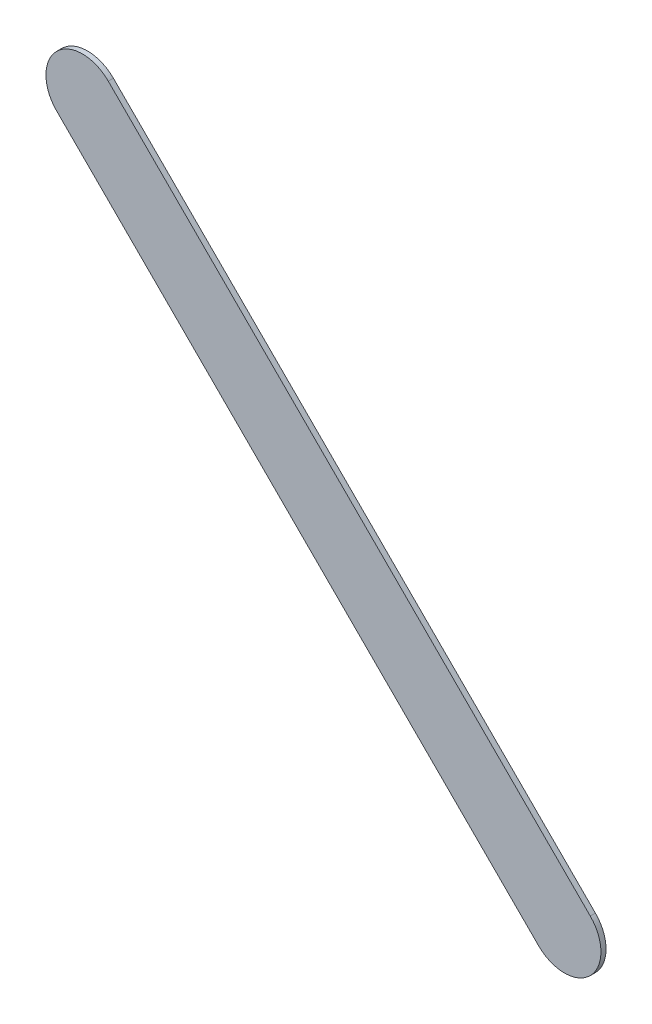
ISO-10303-21;
HEADER;
FILE_DESCRIPTION(('STEP AP214'),'2;1');
FILE_NAME('part.step','',(''),(''),'','','');
FILE_SCHEMA(('AUTOMOTIVE_DESIGN { 1 0 10303 214 1 1 1 1 }'));
ENDSEC;
DATA;
#1=APPLICATION_CONTEXT('core data for automotive mechanical design processes');
#2=APPLICATION_PROTOCOL_DEFINITION('international standard','automotive_design',2000,#1);
#3=PRODUCT_CONTEXT('',#1,'mechanical');
#4=PRODUCT('Part','Part','',(#3));
#5=PRODUCT_RELATED_PRODUCT_CATEGORY('part','',(#4));
#6=PRODUCT_DEFINITION_FORMATION('','',#4);
#7=PRODUCT_DEFINITION_CONTEXT('part definition',#1,'design');
#8=PRODUCT_DEFINITION('design','',#6,#7);
#9=PRODUCT_DEFINITION_SHAPE('','',#8);
#10=(LENGTH_UNIT() NAMED_UNIT(*) SI_UNIT(.MILLI.,.METRE.));
#11=(NAMED_UNIT(*) PLANE_ANGLE_UNIT() SI_UNIT($,.RADIAN.));
#12=(NAMED_UNIT(*) SI_UNIT($,.STERADIAN.) SOLID_ANGLE_UNIT());
#13=UNCERTAINTY_MEASURE_WITH_UNIT(LENGTH_MEASURE(1.E-05),#10,'distance_accuracy_value','');
#14=(GEOMETRIC_REPRESENTATION_CONTEXT(3) GLOBAL_UNCERTAINTY_ASSIGNED_CONTEXT((#13)) GLOBAL_UNIT_ASSIGNED_CONTEXT((#10,
#11,#12)) REPRESENTATION_CONTEXT('',''));
#15=CARTESIAN_POINT('',(0.,0.,0.));
#16=DIRECTION('',(0.,0.,1.));
#17=DIRECTION('',(1.,0.,0.));
#18=AXIS2_PLACEMENT_3D('',#15,#16,#17);
#19=CARTESIAN_POINT('',(164.161223,-99.871776,0.));
#20=DIRECTION('',(0.,0.,1.));
#21=DIRECTION('',(1.,0.,0.));
#22=AXIS2_PLACEMENT_3D('',#19,#20,#21);
#23=PLANE('',#22);
#24=DIRECTION('',(0.707106781186548,-0.707106781186548,0.));
#25=VECTOR('',#24,1.);
#26=CARTESIAN_POINT('',(164.161223,-99.871776,0.));
#27=LINE('',#26,#25);
#28=CARTESIAN_POINT('',(164.161223,-99.871776,0.));
#29=VERTEX_POINT('',#28);
#30=CARTESIAN_POINT('',(167.463223,-103.173776,0.));
#31=VERTEX_POINT('',#30);
#32=EDGE_CURVE('E81',#29,#31,#27,.T.);
#33=ORIENTED_EDGE('',*,*,#32,.T.);
#34=CARTESIAN_POINT('',(167.6399995,-102.9969995,0.));
#35=DIRECTION('',(0.,0.,1.));
#36=DIRECTION('',(-0.707106781186548,-0.707106781186548,0.));
#37=AXIS2_PLACEMENT_3D('',#34,#35,#36);
#38=CIRCLE('',#37,0.249999723809);
#39=CARTESIAN_POINT('',(167.816776,-102.820223,0.));
#40=VERTEX_POINT('',#39);
#41=EDGE_CURVE('E79',#31,#40,#38,.T.);
#42=ORIENTED_EDGE('',*,*,#41,.T.);
#43=DIRECTION('',(-0.707106781186548,0.707106781186548,0.));
#44=VECTOR('',#43,1.);
#45=CARTESIAN_POINT('',(167.816776,-102.820223,0.));
#46=LINE('',#45,#44);
#47=CARTESIAN_POINT('',(164.514776,-99.518223,0.));
#48=VERTEX_POINT('',#47);
#49=EDGE_CURVE('E69',#40,#48,#46,.T.);
#50=ORIENTED_EDGE('',*,*,#49,.T.);
#51=CARTESIAN_POINT('',(164.3379995,-99.6949995,0.));
#52=DIRECTION('',(0.,0.,1.));
#53=DIRECTION('',(0.707106781186548,0.707106781186548,0.));
#54=AXIS2_PLACEMENT_3D('',#51,#52,#53);
#55=CIRCLE('',#54,0.249999723809);
#56=EDGE_CURVE('E11',#48,#29,#55,.T.);
#57=ORIENTED_EDGE('',*,*,#56,.T.);
#58=EDGE_LOOP('',(#33,#42,#50,#57));
#59=FACE_BOUND('',#58,.T.);
#60=ADVANCED_FACE('F17',(#59),#23,.T.);
#61=CARTESIAN_POINT('',(164.161223,-99.871776,-0.035));
#62=DIRECTION('',(0.,0.,1.));
#63=DIRECTION('',(1.,0.,0.));
#64=AXIS2_PLACEMENT_3D('',#61,#62,#63);
#65=PLANE('',#64);
#66=CARTESIAN_POINT('',(164.3379995,-99.6949995,-0.035));
#67=DIRECTION('',(0.,0.,1.));
#68=DIRECTION('',(0.707106781186548,0.707106781186548,0.));
#69=AXIS2_PLACEMENT_3D('',#66,#67,#68);
#70=CIRCLE('',#69,0.249999723809);
#71=CARTESIAN_POINT('',(164.514776,-99.518223,-0.035));
#72=VERTEX_POINT('',#71);
#73=CARTESIAN_POINT('',(164.161223,-99.871776,-0.035));
#74=VERTEX_POINT('',#73);
#75=EDGE_CURVE('E20',#72,#74,#70,.T.);
#76=ORIENTED_EDGE('',*,*,#75,.F.);
#77=DIRECTION('',(-0.707106781186548,0.707106781186548,0.));
#78=VECTOR('',#77,1.);
#79=CARTESIAN_POINT('',(167.816776,-102.820223,-0.035));
#80=LINE('',#79,#78);
#81=CARTESIAN_POINT('',(167.816776,-102.820223,-0.035));
#82=VERTEX_POINT('',#81);
#83=EDGE_CURVE('E61',#82,#72,#80,.T.);
#84=ORIENTED_EDGE('',*,*,#83,.F.);
#85=CARTESIAN_POINT('',(167.6399995,-102.9969995,-0.035));
#86=DIRECTION('',(0.,0.,1.));
#87=DIRECTION('',(-0.707106781186548,-0.707106781186548,0.));
#88=AXIS2_PLACEMENT_3D('',#85,#86,#87);
#89=CIRCLE('',#88,0.249999723809);
#90=CARTESIAN_POINT('',(167.463223,-103.173776,-0.035));
#91=VERTEX_POINT('',#90);
#92=EDGE_CURVE('E88',#91,#82,#89,.T.);
#93=ORIENTED_EDGE('',*,*,#92,.F.);
#94=DIRECTION('',(0.707106781186548,-0.707106781186548,0.));
#95=VECTOR('',#94,1.);
#96=CARTESIAN_POINT('',(164.161223,-99.871776,-0.035));
#97=LINE('',#96,#95);
#98=EDGE_CURVE('E108',#74,#91,#97,.T.);
#99=ORIENTED_EDGE('',*,*,#98,.F.);
#100=EDGE_LOOP('',(#76,#84,#93,#99));
#101=FACE_BOUND('',#100,.T.);
#102=ADVANCED_FACE('F179',(#101),#65,.F.);
#103=CARTESIAN_POINT('',(164.3379995,-99.6949995,-0.035));
#104=DIRECTION('',(0.,0.,-1.));
#105=DIRECTION('',(0.707106781186548,0.707106781186548,0.));
#106=AXIS2_PLACEMENT_3D('',#103,#104,#105);
#107=CYLINDRICAL_SURFACE('',#106,0.249999723809);
#108=ORIENTED_EDGE('',*,*,#75,.T.);
#109=DIRECTION('',(0.,0.,1.));
#110=VECTOR('',#109,1.);
#111=CARTESIAN_POINT('',(164.161223,-99.871776,-0.035));
#112=LINE('',#111,#110);
#113=EDGE_CURVE('E95',#74,#29,#112,.T.);
#114=ORIENTED_EDGE('',*,*,#113,.T.);
#115=ORIENTED_EDGE('',*,*,#56,.F.);
#116=DIRECTION('',(0.,0.,1.));
#117=VECTOR('',#116,1.);
#118=CARTESIAN_POINT('',(164.514776,-99.518223,-0.035));
#119=LINE('',#118,#117);
#120=EDGE_CURVE('E75',#72,#48,#119,.T.);
#121=ORIENTED_EDGE('',*,*,#120,.F.);
#122=EDGE_LOOP('',(#108,#114,#115,#121));
#123=FACE_BOUND('',#122,.T.);
#124=ADVANCED_FACE('F171',(#123),#107,.T.);
#125=CARTESIAN_POINT('',(167.816776,-102.820223,-0.035));
#126=DIRECTION('',(-0.707106781186548,-0.707106781186548,0.));
#127=DIRECTION('',(-0.707106781186548,0.707106781186548,0.));
#128=AXIS2_PLACEMENT_3D('',#125,#126,#127);
#129=PLANE('',#128);
#130=ORIENTED_EDGE('',*,*,#83,.T.);
#131=ORIENTED_EDGE('',*,*,#120,.T.);
#132=ORIENTED_EDGE('',*,*,#49,.F.);
#133=DIRECTION('',(0.,0.,1.));
#134=VECTOR('',#133,1.);
#135=CARTESIAN_POINT('',(167.816776,-102.820223,-0.035));
#136=LINE('',#135,#134);
#137=EDGE_CURVE('E73',#82,#40,#136,.T.);
#138=ORIENTED_EDGE('',*,*,#137,.F.);
#139=EDGE_LOOP('',(#130,#131,#132,#138));
#140=FACE_BOUND('',#139,.T.);
#141=ADVANCED_FACE('F71',(#140),#129,.F.);
#142=CARTESIAN_POINT('',(167.6399995,-102.9969995,-0.035));
#143=DIRECTION('',(0.,0.,-1.));
#144=DIRECTION('',(-0.707106781186548,-0.707106781186548,0.));
#145=AXIS2_PLACEMENT_3D('',#142,#143,#144);
#146=CYLINDRICAL_SURFACE('',#145,0.249999723809);
#147=ORIENTED_EDGE('',*,*,#92,.T.);
#148=ORIENTED_EDGE('',*,*,#137,.T.);
#149=ORIENTED_EDGE('',*,*,#41,.F.);
#150=DIRECTION('',(0.,0.,1.));
#151=VECTOR('',#150,1.);
#152=CARTESIAN_POINT('',(167.463223,-103.173776,-0.035));
#153=LINE('',#152,#151);
#154=EDGE_CURVE('E109',#91,#31,#153,.T.);
#155=ORIENTED_EDGE('',*,*,#154,.F.);
#156=EDGE_LOOP('',(#147,#148,#149,#155));
#157=FACE_BOUND('',#156,.T.);
#158=ADVANCED_FACE('F87',(#157),#146,.T.);
#159=CARTESIAN_POINT('',(164.161223,-99.871776,-0.035));
#160=DIRECTION('',(0.707106781186548,0.707106781186548,0.));
#161=DIRECTION('',(0.,0.,-1.));
#162=AXIS2_PLACEMENT_3D('',#159,#160,#161);
#163=PLANE('',#162);
#164=ORIENTED_EDGE('',*,*,#98,.T.);
#165=ORIENTED_EDGE('',*,*,#154,.T.);
#166=ORIENTED_EDGE('',*,*,#32,.F.);
#167=ORIENTED_EDGE('',*,*,#113,.F.);
#168=EDGE_LOOP('',(#164,#165,#166,#167));
#169=FACE_BOUND('',#168,.T.);
#170=ADVANCED_FACE('F137',(#169),#163,.F.);
#171=CLOSED_SHELL('',(#60,#102,#124,#141,#158,#170));
#172=MANIFOLD_SOLID_BREP('B1',#171);
#173=ADVANCED_BREP_SHAPE_REPRESENTATION('',(#18,#172),#14);
#174=SHAPE_DEFINITION_REPRESENTATION(#9,#173);
ENDSEC;
END-ISO-10303-21;
